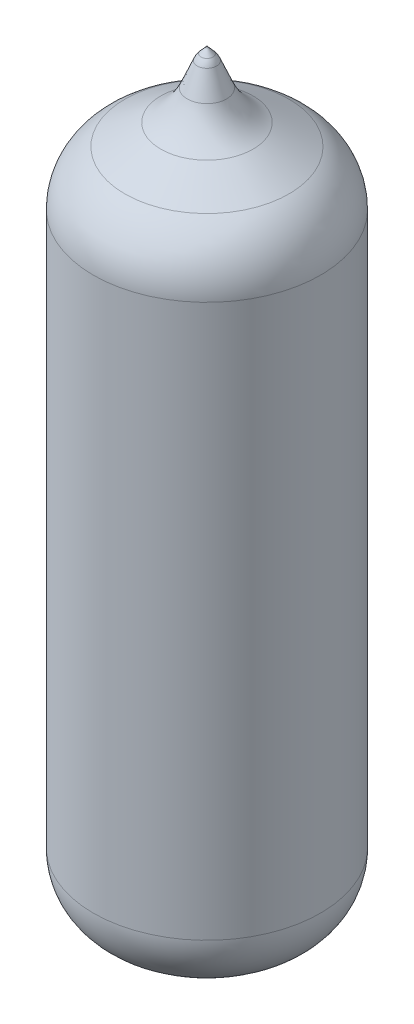
ISO-10303-21;
HEADER;
FILE_DESCRIPTION(('STEP AP214'),'2;1');
FILE_NAME('part.step','',(''),(''),'','','');
FILE_SCHEMA(('AUTOMOTIVE_DESIGN { 1 0 10303 214 1 1 1 1 }'));
ENDSEC;
DATA;
#1=APPLICATION_CONTEXT('core data for automotive mechanical design processes');
#2=APPLICATION_PROTOCOL_DEFINITION('international standard','automotive_design',2000,#1);
#3=PRODUCT_CONTEXT('',#1,'mechanical');
#4=PRODUCT('Part','Part','',(#3));
#5=PRODUCT_RELATED_PRODUCT_CATEGORY('part','',(#4));
#6=PRODUCT_DEFINITION_FORMATION('','',#4);
#7=PRODUCT_DEFINITION_CONTEXT('part definition',#1,'design');
#8=PRODUCT_DEFINITION('design','',#6,#7);
#9=PRODUCT_DEFINITION_SHAPE('','',#8);
#10=(LENGTH_UNIT() NAMED_UNIT(*) SI_UNIT(.MILLI.,.METRE.));
#11=(NAMED_UNIT(*) PLANE_ANGLE_UNIT() SI_UNIT($,.RADIAN.));
#12=(NAMED_UNIT(*) SI_UNIT($,.STERADIAN.) SOLID_ANGLE_UNIT());
#13=UNCERTAINTY_MEASURE_WITH_UNIT(LENGTH_MEASURE(1.E-05),#10,'distance_accuracy_value','');
#14=(GEOMETRIC_REPRESENTATION_CONTEXT(3) GLOBAL_UNCERTAINTY_ASSIGNED_CONTEXT((#13)) GLOBAL_UNIT_ASSIGNED_CONTEXT((#10,
#11,#12)) REPRESENTATION_CONTEXT('',''));
#15=CARTESIAN_POINT('',(0.,0.,0.));
#16=DIRECTION('',(0.,0.,1.));
#17=DIRECTION('',(1.,0.,0.));
#18=AXIS2_PLACEMENT_3D('',#15,#16,#17);
#19=CARTESIAN_POINT('',(0.,36.,0.));
#20=DIRECTION('',(0.,-1.,0.));
#21=DIRECTION('',(0.,0.,-1.));
#22=AXIS2_PLACEMENT_3D('',#19,#20,#21);
#23=CONICAL_SURFACE('',#22,0.,0.730465561461137);
#24=CARTESIAN_POINT('',(0.,35.6847603388168,0.));
#25=DIRECTION('',(0.,1.,0.));
#26=DIRECTION('',(0.,0.,1.));
#27=AXIS2_PLACEMENT_3D('',#24,#25,#26);
#28=CIRCLE('',#27,0.282377911845358);
#29=CARTESIAN_POINT('',(0.,35.6847603388168,0.282377911845358));
#30=VERTEX_POINT('',#29);
#31=EDGE_CURVE('E11',#30,#30,#28,.T.);
#32=ORIENTED_EDGE('',*,*,#31,.T.);
#33=EDGE_LOOP('',(#32));
#34=FACE_BOUND('',#33,.T.);
#35=CARTESIAN_POINT('',(0.,36.,0.));
#36=VERTEX_POINT('',#35);
#37=VERTEX_LOOP('',#36);
#38=FACE_BOUND('',#37,.T.);
#39=ADVANCED_FACE('F34',(#34,#38),#23,.T.);
#40=CARTESIAN_POINT('',(0.,35.0175438516132,0.));
#41=DIRECTION('',(0.,1.,0.));
#42=DIRECTION('',(0.,0.,1.));
#43=AXIS2_PLACEMENT_3D('',#40,#41,#42);
#44=DEGENERATE_TOROIDAL_SURFACE('',#43,0.462485940951731,1.,.F.);
#45=CARTESIAN_POINT('',(0.,35.4048851795125,0.));
#46=DIRECTION('',(0.,1.,0.));
#47=DIRECTION('',(0.,0.,1.));
#48=AXIS2_PLACEMENT_3D('',#45,#46,#47);
#49=CIRCLE('',#48,0.459450442808659);
#50=CARTESIAN_POINT('',(0.,35.4048851795125,0.459450442808659));
#51=VERTEX_POINT('',#50);
#52=EDGE_CURVE('E40',#51,#51,#49,.T.);
#53=ORIENTED_EDGE('',*,*,#52,.T.);
#54=EDGE_LOOP('',(#53));
#55=FACE_BOUND('',#54,.T.);
#56=ORIENTED_EDGE('',*,*,#31,.F.);
#57=EDGE_LOOP('',(#56));
#58=FACE_BOUND('',#57,.T.);
#59=ADVANCED_FACE('F44',(#55,#58),#44,.F.);
#60=CARTESIAN_POINT('',(0.,35.4048851795125,0.));
#61=DIRECTION('',(0.,-1.,0.));
#62=DIRECTION('',(0.,0.,-1.));
#63=AXIS2_PLACEMENT_3D('',#60,#61,#62);
#64=CONICAL_SURFACE('',#63,0.459450442808659,0.397746048306895);
#65=CARTESIAN_POINT('',(0.,34.2838342091496,0.));
#66=DIRECTION('',(0.,1.,0.));
#67=DIRECTION('',(0.,0.,1.));
#68=AXIS2_PLACEMENT_3D('',#65,#66,#67);
#69=CIRCLE('',#68,0.930447551884731);
#70=CARTESIAN_POINT('',(0.,34.2838342091496,0.930447551884731));
#71=VERTEX_POINT('',#70);
#72=EDGE_CURVE('E102',#71,#71,#69,.T.);
#73=ORIENTED_EDGE('',*,*,#72,.T.);
#74=EDGE_LOOP('',(#73));
#75=FACE_BOUND('',#74,.T.);
#76=ORIENTED_EDGE('',*,*,#52,.F.);
#77=EDGE_LOOP('',(#76));
#78=FACE_BOUND('',#77,.T.);
#79=ADVANCED_FACE('F49',(#75,#78),#64,.T.);
#80=CARTESIAN_POINT('',(0.,35.4458581928476,0.));
#81=DIRECTION('',(0.,1.,0.));
#82=DIRECTION('',(0.,0.,1.));
#83=AXIS2_PLACEMENT_3D('',#80,#81,#82);
#84=TOROIDAL_SURFACE('',#83,3.6962567031659,3.);
#85=CARTESIAN_POINT('',(0.,32.8491769268944,0.));
#86=DIRECTION('',(0.,1.,0.));
#87=DIRECTION('',(0.,0.,1.));
#88=AXIS2_PLACEMENT_3D('',#85,#86,#87);
#89=CIRCLE('',#88,2.19384317718584);
#90=CARTESIAN_POINT('',(0.,32.8491769268944,2.19384317718584));
#91=VERTEX_POINT('',#90);
#92=EDGE_CURVE('E99',#91,#91,#89,.T.);
#93=ORIENTED_EDGE('',*,*,#92,.T.);
#94=EDGE_LOOP('',(#93));
#95=FACE_BOUND('',#94,.T.);
#96=ORIENTED_EDGE('',*,*,#72,.F.);
#97=EDGE_LOOP('',(#96));
#98=FACE_BOUND('',#97,.T.);
#99=ADVANCED_FACE('F56',(#95,#98),#84,.F.);
#100=CARTESIAN_POINT('',(0.,32.8491769268944,0.));
#101=DIRECTION('',(0.,-1.,0.));
#102=DIRECTION('',(0.,0.,-1.));
#103=AXIS2_PLACEMENT_3D('',#100,#101,#102);
#104=CONICAL_SURFACE('',#103,2.19384317718584,1.04626833522571);
#105=CARTESIAN_POINT('',(0.,31.8606153980791,0.));
#106=DIRECTION('',(0.,1.,0.));
#107=DIRECTION('',(0.,0.,1.));
#108=AXIS2_PLACEMENT_3D('',#105,#106,#107);
#109=CIRCLE('',#108,3.90241352598006);
#110=CARTESIAN_POINT('',(0.,31.8606153980791,3.90241352598006));
#111=VERTEX_POINT('',#110);
#112=EDGE_CURVE('E96',#111,#111,#109,.T.);
#113=ORIENTED_EDGE('',*,*,#112,.T.);
#114=EDGE_LOOP('',(#113));
#115=FACE_BOUND('',#114,.T.);
#116=ORIENTED_EDGE('',*,*,#92,.F.);
#117=EDGE_LOOP('',(#116));
#118=FACE_BOUND('',#117,.T.);
#119=ADVANCED_FACE('F63',(#115,#118),#104,.T.);
#120=CARTESIAN_POINT('',(0.,29.2639341321259,0.));
#121=DIRECTION('',(0.,1.,0.));
#122=DIRECTION('',(0.,0.,1.));
#123=AXIS2_PLACEMENT_3D('',#120,#121,#122);
#124=DEGENERATE_TOROIDAL_SURFACE('',#123,2.4,3.,.T.);
#125=CARTESIAN_POINT('',(0.,29.2639341321259,0.));
#126=DIRECTION('',(0.,1.,0.));
#127=DIRECTION('',(0.,0.,1.));
#128=AXIS2_PLACEMENT_3D('',#125,#126,#127);
#129=CIRCLE('',#128,5.4);
#130=CARTESIAN_POINT('',(0.,29.2639341321259,5.4));
#131=VERTEX_POINT('',#130);
#132=EDGE_CURVE('E91',#131,#131,#129,.T.);
#133=ORIENTED_EDGE('',*,*,#132,.T.);
#134=EDGE_LOOP('',(#133));
#135=FACE_BOUND('',#134,.T.);
#136=ORIENTED_EDGE('',*,*,#112,.F.);
#137=EDGE_LOOP('',(#136));
#138=FACE_BOUND('',#137,.T.);
#139=ADVANCED_FACE('F67',(#135,#138),#124,.T.);
#140=CARTESIAN_POINT('',(0.,36.,0.));
#141=DIRECTION('',(0.,1.,0.));
#142=DIRECTION('',(0.,0.,1.));
#143=AXIS2_PLACEMENT_3D('',#140,#141,#142);
#144=CYLINDRICAL_SURFACE('',#143,5.4);
#145=CARTESIAN_POINT('',(0.,3.00000000000002,0.));
#146=DIRECTION('',(0.,1.,0.));
#147=DIRECTION('',(0.,0.,1.));
#148=AXIS2_PLACEMENT_3D('',#145,#146,#147);
#149=CIRCLE('',#148,5.4);
#150=CARTESIAN_POINT('',(0.,3.00000000000002,5.4));
#151=VERTEX_POINT('',#150);
#152=EDGE_CURVE('E88',#151,#151,#149,.T.);
#153=ORIENTED_EDGE('',*,*,#152,.T.);
#154=EDGE_LOOP('',(#153));
#155=FACE_BOUND('',#154,.T.);
#156=ORIENTED_EDGE('',*,*,#132,.F.);
#157=EDGE_LOOP('',(#156));
#158=FACE_BOUND('',#157,.T.);
#159=ADVANCED_FACE('F71',(#155,#158),#144,.T.);
#160=CARTESIAN_POINT('',(0.,3.,0.));
#161=DIRECTION('',(0.,1.,0.));
#162=DIRECTION('',(0.,0.,1.));
#163=AXIS2_PLACEMENT_3D('',#160,#161,#162);
#164=DEGENERATE_TOROIDAL_SURFACE('',#163,2.4,3.,.T.);
#165=CARTESIAN_POINT('',(0.,0.,0.));
#166=DIRECTION('',(0.,1.,0.));
#167=DIRECTION('',(0.,0.,1.));
#168=AXIS2_PLACEMENT_3D('',#165,#166,#167);
#169=CIRCLE('',#168,2.39999999999998);
#170=CARTESIAN_POINT('',(0.,0.,2.39999999999998));
#171=VERTEX_POINT('',#170);
#172=EDGE_CURVE('E87',#171,#171,#169,.T.);
#173=ORIENTED_EDGE('',*,*,#172,.T.);
#174=EDGE_LOOP('',(#173));
#175=FACE_BOUND('',#174,.T.);
#176=ORIENTED_EDGE('',*,*,#152,.F.);
#177=EDGE_LOOP('',(#176));
#178=FACE_BOUND('',#177,.T.);
#179=ADVANCED_FACE('F75',(#175,#178),#164,.T.);
#180=CARTESIAN_POINT('',(0.,0.,0.));
#181=DIRECTION('',(0.,-1.,0.));
#182=DIRECTION('',(0.,0.,-1.));
#183=AXIS2_PLACEMENT_3D('',#180,#181,#182);
#184=PLANE('',#183);
#185=ORIENTED_EDGE('',*,*,#172,.F.);
#186=EDGE_LOOP('',(#185));
#187=FACE_BOUND('',#186,.T.);
#188=ADVANCED_FACE('F79',(#187),#184,.T.);
#189=CLOSED_SHELL('',(#39,#59,#79,#99,#119,#139,#159,#179,#188));
#190=MANIFOLD_SOLID_BREP('B2',#189);
#191=ADVANCED_BREP_SHAPE_REPRESENTATION('',(#18,#190),#14);
#192=SHAPE_DEFINITION_REPRESENTATION(#9,#191);
ENDSEC;
END-ISO-10303-21;
